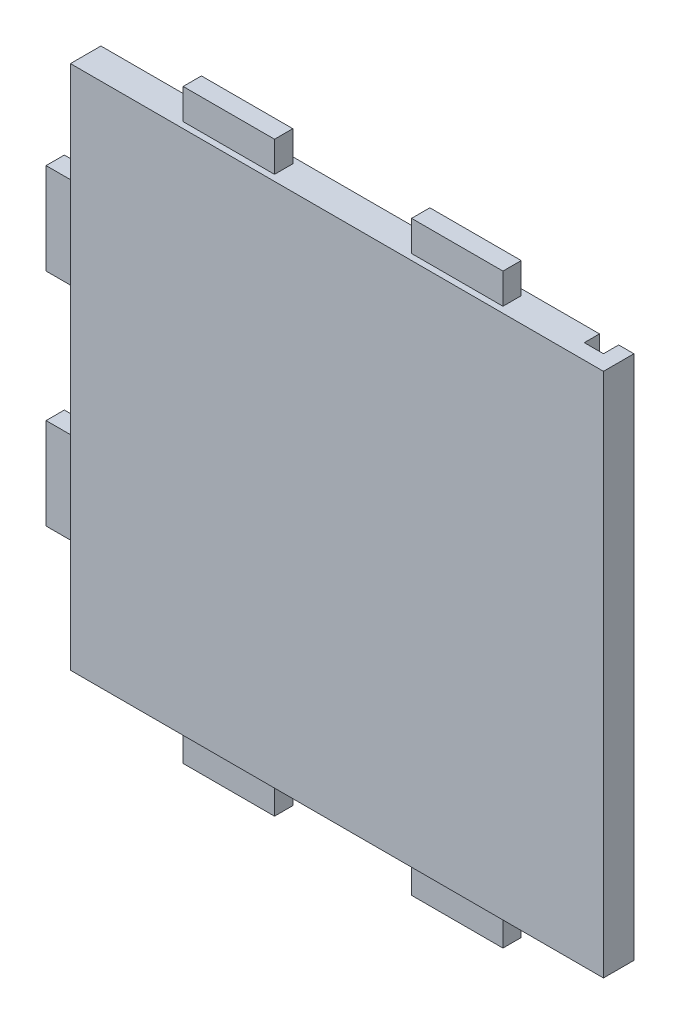
ISO-10303-21;
HEADER;
FILE_DESCRIPTION(('STEP AP214'),'2;1');
FILE_NAME('part.step','',(''),(''),'','','');
FILE_SCHEMA(('AUTOMOTIVE_DESIGN { 1 0 10303 214 1 1 1 1 }'));
ENDSEC;
DATA;
#1=APPLICATION_CONTEXT('core data for automotive mechanical design processes');
#2=APPLICATION_PROTOCOL_DEFINITION('international standard','automotive_design',2000,#1);
#3=PRODUCT_CONTEXT('',#1,'mechanical');
#4=PRODUCT('Part','Part','',(#3));
#5=PRODUCT_RELATED_PRODUCT_CATEGORY('part','',(#4));
#6=PRODUCT_DEFINITION_FORMATION('','',#4);
#7=PRODUCT_DEFINITION_CONTEXT('part definition',#1,'design');
#8=PRODUCT_DEFINITION('design','',#6,#7);
#9=PRODUCT_DEFINITION_SHAPE('','',#8);
#10=(LENGTH_UNIT() NAMED_UNIT(*) SI_UNIT(.MILLI.,.METRE.));
#11=(NAMED_UNIT(*) PLANE_ANGLE_UNIT() SI_UNIT($,.RADIAN.));
#12=(NAMED_UNIT(*) SI_UNIT($,.STERADIAN.) SOLID_ANGLE_UNIT());
#13=UNCERTAINTY_MEASURE_WITH_UNIT(LENGTH_MEASURE(1.E-05),#10,'distance_accuracy_value','');
#14=(GEOMETRIC_REPRESENTATION_CONTEXT(3) GLOBAL_UNCERTAINTY_ASSIGNED_CONTEXT((#13)) GLOBAL_UNIT_ASSIGNED_CONTEXT((#10,
#11,#12)) REPRESENTATION_CONTEXT('',''));
#15=CARTESIAN_POINT('',(0.,0.,0.));
#16=DIRECTION('',(0.,0.,1.));
#17=DIRECTION('',(1.,0.,0.));
#18=AXIS2_PLACEMENT_3D('',#15,#16,#17);
#19=CARTESIAN_POINT('',(0.,0.,0.));
#20=DIRECTION('',(0.,0.,1.));
#21=DIRECTION('',(1.,0.,0.));
#22=AXIS2_PLACEMENT_3D('',#19,#20,#21);
#23=PLANE('',#22);
#24=DIRECTION('',(1.,0.,0.));
#25=VECTOR('',#24,1.);
#26=CARTESIAN_POINT('',(87.5,-86.25,0.));
#27=LINE('',#26,#25);
#28=CARTESIAN_POINT('',(82.5,-86.25,0.));
#29=VERTEX_POINT('',#28);
#30=CARTESIAN_POINT('',(87.5,-86.25,0.));
#31=VERTEX_POINT('',#30);
#32=EDGE_CURVE('E487',#29,#31,#27,.T.);
#33=ORIENTED_EDGE('',*,*,#32,.F.);
#34=DIRECTION('',(0.,-1.,0.));
#35=VECTOR('',#34,1.);
#36=CARTESIAN_POINT('',(82.5,-86.25,0.));
#37=LINE('',#36,#35);
#38=CARTESIAN_POINT('',(82.5,86.25,0.));
#39=VERTEX_POINT('',#38);
#40=EDGE_CURVE('E246',#39,#29,#37,.T.);
#41=ORIENTED_EDGE('',*,*,#40,.F.);
#42=DIRECTION('',(-1.,0.,0.));
#43=VECTOR('',#42,1.);
#44=CARTESIAN_POINT('',(87.5,86.25,0.));
#45=LINE('',#44,#43);
#46=CARTESIAN_POINT('',(87.5,86.25,0.));
#47=VERTEX_POINT('',#46);
#48=EDGE_CURVE('E478',#47,#39,#45,.T.);
#49=ORIENTED_EDGE('',*,*,#48,.F.);
#50=DIRECTION('',(0.,1.,0.));
#51=VECTOR('',#50,1.);
#52=CARTESIAN_POINT('',(87.5,-86.25,0.));
#53=LINE('',#52,#51);
#54=EDGE_CURVE('E490',#31,#47,#53,.T.);
#55=ORIENTED_EDGE('',*,*,#54,.F.);
#56=EDGE_LOOP('',(#33,#41,#49,#55));
#57=FACE_BOUND('',#56,.T.);
#58=ADVANCED_FACE('F32',(#57),#23,.F.);
#59=CARTESIAN_POINT('',(87.5,-86.25,10.));
#60=DIRECTION('',(0.,1.,0.));
#61=DIRECTION('',(-1.,0.,0.));
#62=AXIS2_PLACEMENT_3D('',#59,#60,#61);
#63=PLANE('',#62);
#64=CARTESIAN_POINT('',(65.,-86.25,5.00000000000061));
#65=DIRECTION('',(0.,-1.,0.));
#66=DIRECTION('',(1.,0.,0.));
#67=AXIS2_PLACEMENT_3D('',#64,#65,#66);
#68=CIRCLE('',#67,1.5);
#69=CARTESIAN_POINT('',(66.5,-86.25,5.00000000000061));
#70=VERTEX_POINT('',#69);
#71=EDGE_CURVE('E764',#70,#70,#68,.T.);
#72=ORIENTED_EDGE('',*,*,#71,.F.);
#73=EDGE_LOOP('',(#72));
#74=FACE_BOUND('',#73,.T.);
#75=DIRECTION('',(0.,0.,-1.));
#76=VECTOR('',#75,1.);
#77=CARTESIAN_POINT('',(-52.5,-86.25,2.));
#78=LINE('',#77,#76);
#79=CARTESIAN_POINT('',(-52.5,-86.25,8.));
#80=VERTEX_POINT('',#79);
#81=CARTESIAN_POINT('',(-52.5,-86.25,2.));
#82=VERTEX_POINT('',#81);
#83=EDGE_CURVE('E308',#80,#82,#78,.T.);
#84=ORIENTED_EDGE('',*,*,#83,.F.);
#85=DIRECTION('',(-1.,0.,0.));
#86=VECTOR('',#85,1.);
#87=CARTESIAN_POINT('',(-22.5,-86.25,8.));
#88=LINE('',#87,#86);
#89=CARTESIAN_POINT('',(-22.5,-86.25,8.));
#90=VERTEX_POINT('',#89);
#91=EDGE_CURVE('E313',#90,#80,#88,.T.);
#92=ORIENTED_EDGE('',*,*,#91,.F.);
#93=DIRECTION('',(0.,0.,1.));
#94=VECTOR('',#93,1.);
#95=CARTESIAN_POINT('',(-22.5,-86.25,2.));
#96=LINE('',#95,#94);
#97=CARTESIAN_POINT('',(-22.5,-86.25,2.));
#98=VERTEX_POINT('',#97);
#99=EDGE_CURVE('E325',#98,#90,#96,.T.);
#100=ORIENTED_EDGE('',*,*,#99,.F.);
#101=DIRECTION('',(1.,0.,0.));
#102=VECTOR('',#101,1.);
#103=CARTESIAN_POINT('',(-22.5,-86.25,2.));
#104=LINE('',#103,#102);
#105=EDGE_CURVE('E322',#82,#98,#104,.T.);
#106=ORIENTED_EDGE('',*,*,#105,.F.);
#107=EDGE_LOOP('',(#84,#92,#100,#106));
#108=FACE_BOUND('',#107,.T.);
#109=DIRECTION('',(-1.,0.,0.));
#110=VECTOR('',#109,1.);
#111=CARTESIAN_POINT('',(76.2,-86.25,5.));
#112=LINE('',#111,#110);
#113=CARTESIAN_POINT('',(82.5,-86.25,5.));
#114=VERTEX_POINT('',#113);
#115=CARTESIAN_POINT('',(76.2,-86.25,5.));
#116=VERTEX_POINT('',#115);
#117=EDGE_CURVE('E256',#114,#116,#112,.T.);
#118=ORIENTED_EDGE('',*,*,#117,.F.);
#119=DIRECTION('',(0.,0.,-1.));
#120=VECTOR('',#119,1.);
#121=CARTESIAN_POINT('',(82.5,-86.25,5.));
#122=LINE('',#121,#120);
#123=EDGE_CURVE('E240',#114,#29,#122,.T.);
#124=ORIENTED_EDGE('',*,*,#123,.T.);
#125=ORIENTED_EDGE('',*,*,#32,.T.);
#126=DIRECTION('',(0.,0.,-1.));
#127=VECTOR('',#126,1.);
#128=CARTESIAN_POINT('',(87.5,-86.25,10.));
#129=LINE('',#128,#127);
#130=CARTESIAN_POINT('',(87.5,-86.25,10.));
#131=VERTEX_POINT('',#130);
#132=EDGE_CURVE('E40',#131,#31,#129,.T.);
#133=ORIENTED_EDGE('',*,*,#132,.F.);
#134=DIRECTION('',(1.,0.,0.));
#135=VECTOR('',#134,1.);
#136=CARTESIAN_POINT('',(87.5,-86.25,10.));
#137=LINE('',#136,#135);
#138=CARTESIAN_POINT('',(-87.5,-86.25,10.));
#139=VERTEX_POINT('',#138);
#140=EDGE_CURVE('E477',#139,#131,#137,.T.);
#141=ORIENTED_EDGE('',*,*,#140,.F.);
#142=DIRECTION('',(0.,0.,-1.));
#143=VECTOR('',#142,1.);
#144=CARTESIAN_POINT('',(-87.5,-86.25,10.));
#145=LINE('',#144,#143);
#146=CARTESIAN_POINT('',(-87.5,-86.25,0.));
#147=VERTEX_POINT('',#146);
#148=EDGE_CURVE('E11',#139,#147,#145,.T.);
#149=ORIENTED_EDGE('',*,*,#148,.T.);
#150=CARTESIAN_POINT('',(76.2,-86.25,0.));
#151=VERTEX_POINT('',#150);
#152=EDGE_CURVE('E488',#147,#151,#27,.T.);
#153=ORIENTED_EDGE('',*,*,#152,.T.);
#154=DIRECTION('',(0.,0.,-1.));
#155=VECTOR('',#154,1.);
#156=CARTESIAN_POINT('',(76.2,-86.25,5.));
#157=LINE('',#156,#155);
#158=EDGE_CURVE('E47',#116,#151,#157,.T.);
#159=ORIENTED_EDGE('',*,*,#158,.F.);
#160=EDGE_LOOP('',(#118,#124,#125,#133,#141,#149,#153,#159));
#161=FACE_BOUND('',#160,.T.);
#162=DIRECTION('',(0.,0.,-1.));
#163=VECTOR('',#162,1.);
#164=CARTESIAN_POINT('',(22.5,-86.25,2.));
#165=LINE('',#164,#163);
#166=CARTESIAN_POINT('',(22.5,-86.25,8.));
#167=VERTEX_POINT('',#166);
#168=CARTESIAN_POINT('',(22.5,-86.25,2.));
#169=VERTEX_POINT('',#168);
#170=EDGE_CURVE('E274',#167,#169,#165,.T.);
#171=ORIENTED_EDGE('',*,*,#170,.F.);
#172=DIRECTION('',(-1.,0.,0.));
#173=VECTOR('',#172,1.);
#174=CARTESIAN_POINT('',(22.5,-86.25,8.));
#175=LINE('',#174,#173);
#176=CARTESIAN_POINT('',(52.5,-86.25,8.));
#177=VERTEX_POINT('',#176);
#178=EDGE_CURVE('E283',#177,#167,#175,.T.);
#179=ORIENTED_EDGE('',*,*,#178,.F.);
#180=DIRECTION('',(0.,0.,1.));
#181=VECTOR('',#180,1.);
#182=CARTESIAN_POINT('',(52.5,-86.25,2.));
#183=LINE('',#182,#181);
#184=CARTESIAN_POINT('',(52.5,-86.25,2.));
#185=VERTEX_POINT('',#184);
#186=EDGE_CURVE('E293',#185,#177,#183,.T.);
#187=ORIENTED_EDGE('',*,*,#186,.F.);
#188=DIRECTION('',(1.,0.,0.));
#189=VECTOR('',#188,1.);
#190=CARTESIAN_POINT('',(22.5,-86.25,2.));
#191=LINE('',#190,#189);
#192=EDGE_CURVE('E55',#169,#185,#191,.T.);
#193=ORIENTED_EDGE('',*,*,#192,.F.);
#194=EDGE_LOOP('',(#171,#179,#187,#193));
#195=FACE_BOUND('',#194,.T.);
#196=ADVANCED_FACE('F261',(#74,#108,#161,#195),#63,.F.);
#197=CARTESIAN_POINT('',(-87.5,-86.25,10.));
#198=DIRECTION('',(1.,0.,0.));
#199=DIRECTION('',(0.,0.,-1.));
#200=AXIS2_PLACEMENT_3D('',#197,#198,#199);
#201=PLANE('',#200);
#202=CARTESIAN_POINT('',(-87.5,-71.25,5.00000000000002));
#203=DIRECTION('',(-1.,0.,0.));
#204=DIRECTION('',(0.,0.,1.));
#205=AXIS2_PLACEMENT_3D('',#202,#203,#204);
#206=CIRCLE('',#205,1.5);
#207=CARTESIAN_POINT('',(-87.5,-71.25,6.50000000000002));
#208=VERTEX_POINT('',#207);
#209=EDGE_CURVE('E763',#208,#208,#206,.T.);
#210=ORIENTED_EDGE('',*,*,#209,.F.);
#211=EDGE_LOOP('',(#210));
#212=FACE_BOUND('',#211,.T.);
#213=DIRECTION('',(0.,-1.,0.));
#214=VECTOR('',#213,1.);
#215=CARTESIAN_POINT('',(-87.5,21.25,2.00000000000001));
#216=LINE('',#215,#214);
#217=CARTESIAN_POINT('',(-87.5,51.25,2.00000000000001));
#218=VERTEX_POINT('',#217);
#219=CARTESIAN_POINT('',(-87.5,21.25,2.00000000000001));
#220=VERTEX_POINT('',#219);
#221=EDGE_CURVE('E374',#218,#220,#216,.T.);
#222=ORIENTED_EDGE('',*,*,#221,.F.);
#223=DIRECTION('',(0.,0.,-1.));
#224=VECTOR('',#223,1.);
#225=CARTESIAN_POINT('',(-87.5,51.25,8.00000000000001));
#226=LINE('',#225,#224);
#227=CARTESIAN_POINT('',(-87.5,51.25,8.00000000000001));
#228=VERTEX_POINT('',#227);
#229=EDGE_CURVE('E379',#228,#218,#226,.T.);
#230=ORIENTED_EDGE('',*,*,#229,.F.);
#231=DIRECTION('',(0.,1.,0.));
#232=VECTOR('',#231,1.);
#233=CARTESIAN_POINT('',(-87.5,21.25,8.00000000000001));
#234=LINE('',#233,#232);
#235=CARTESIAN_POINT('',(-87.5,21.25,8.00000000000001));
#236=VERTEX_POINT('',#235);
#237=EDGE_CURVE('E391',#236,#228,#234,.T.);
#238=ORIENTED_EDGE('',*,*,#237,.F.);
#239=DIRECTION('',(0.,0.,1.));
#240=VECTOR('',#239,1.);
#241=CARTESIAN_POINT('',(-87.5,21.25,8.00000000000001));
#242=LINE('',#241,#240);
#243=EDGE_CURVE('E388',#220,#236,#242,.T.);
#244=ORIENTED_EDGE('',*,*,#243,.F.);
#245=EDGE_LOOP('',(#222,#230,#238,#244));
#246=FACE_BOUND('',#245,.T.);
#247=DIRECTION('',(0.,-1.,0.));
#248=VECTOR('',#247,1.);
#249=CARTESIAN_POINT('',(-87.5,-86.25,0.));
#250=LINE('',#249,#248);
#251=CARTESIAN_POINT('',(-87.5,86.25,0.));
#252=VERTEX_POINT('',#251);
#253=EDGE_CURVE('E473',#252,#147,#250,.T.);
#254=ORIENTED_EDGE('',*,*,#253,.T.);
#255=ORIENTED_EDGE('',*,*,#148,.F.);
#256=DIRECTION('',(0.,-1.,0.));
#257=VECTOR('',#256,1.);
#258=CARTESIAN_POINT('',(-87.5,-86.25,10.));
#259=LINE('',#258,#257);
#260=CARTESIAN_POINT('',(-87.5,86.25,10.));
#261=VERTEX_POINT('',#260);
#262=EDGE_CURVE('E474',#261,#139,#259,.T.);
#263=ORIENTED_EDGE('',*,*,#262,.F.);
#264=DIRECTION('',(0.,0.,-1.));
#265=VECTOR('',#264,1.);
#266=CARTESIAN_POINT('',(-87.5,86.25,10.));
#267=LINE('',#266,#265);
#268=EDGE_CURVE('E484',#261,#252,#267,.T.);
#269=ORIENTED_EDGE('',*,*,#268,.T.);
#270=EDGE_LOOP('',(#254,#255,#263,#269));
#271=FACE_BOUND('',#270,.T.);
#272=DIRECTION('',(0.,1.,0.));
#273=VECTOR('',#272,1.);
#274=CARTESIAN_POINT('',(-87.5,-21.25,8.00000000000001));
#275=LINE('',#274,#273);
#276=CARTESIAN_POINT('',(-87.5,-51.25,8.00000000000001));
#277=VERTEX_POINT('',#276);
#278=CARTESIAN_POINT('',(-87.5,-21.25,8.00000000000001));
#279=VERTEX_POINT('',#278);
#280=EDGE_CURVE('E341',#277,#279,#275,.T.);
#281=ORIENTED_EDGE('',*,*,#280,.F.);
#282=DIRECTION('',(0.,0.,1.));
#283=VECTOR('',#282,1.);
#284=CARTESIAN_POINT('',(-87.5,-51.25,8.00000000000001));
#285=LINE('',#284,#283);
#286=CARTESIAN_POINT('',(-87.5,-51.25,2.00000000000001));
#287=VERTEX_POINT('',#286);
#288=EDGE_CURVE('E346',#287,#277,#285,.T.);
#289=ORIENTED_EDGE('',*,*,#288,.F.);
#290=DIRECTION('',(0.,-1.,0.));
#291=VECTOR('',#290,1.);
#292=CARTESIAN_POINT('',(-87.5,-21.25,2.00000000000001));
#293=LINE('',#292,#291);
#294=CARTESIAN_POINT('',(-87.5,-21.25,2.00000000000001));
#295=VERTEX_POINT('',#294);
#296=EDGE_CURVE('E358',#295,#287,#293,.T.);
#297=ORIENTED_EDGE('',*,*,#296,.F.);
#298=DIRECTION('',(0.,0.,-1.));
#299=VECTOR('',#298,1.);
#300=CARTESIAN_POINT('',(-87.5,-21.25,8.00000000000001));
#301=LINE('',#300,#299);
#302=EDGE_CURVE('E355',#279,#295,#301,.T.);
#303=ORIENTED_EDGE('',*,*,#302,.F.);
#304=EDGE_LOOP('',(#281,#289,#297,#303));
#305=FACE_BOUND('',#304,.T.);
#306=ADVANCED_FACE('F34',(#212,#246,#271,#305),#201,.F.);
#307=CARTESIAN_POINT('',(87.5,86.25,10.));
#308=DIRECTION('',(0.,-1.,0.));
#309=DIRECTION('',(1.,0.,0.));
#310=AXIS2_PLACEMENT_3D('',#307,#308,#309);
#311=PLANE('',#310);
#312=ORIENTED_EDGE('',*,*,#48,.T.);
#313=DIRECTION('',(0.,0.,-1.));
#314=VECTOR('',#313,1.);
#315=CARTESIAN_POINT('',(82.5,86.25,5.));
#316=LINE('',#315,#314);
#317=CARTESIAN_POINT('',(82.5,86.25,5.));
#318=VERTEX_POINT('',#317);
#319=EDGE_CURVE('E272',#318,#39,#316,.T.);
#320=ORIENTED_EDGE('',*,*,#319,.F.);
#321=DIRECTION('',(1.,0.,0.));
#322=VECTOR('',#321,1.);
#323=CARTESIAN_POINT('',(76.2,86.25,5.));
#324=LINE('',#323,#322);
#325=CARTESIAN_POINT('',(76.2,86.25,5.));
#326=VERTEX_POINT('',#325);
#327=EDGE_CURVE('E250',#326,#318,#324,.T.);
#328=ORIENTED_EDGE('',*,*,#327,.F.);
#329=DIRECTION('',(0.,0.,-1.));
#330=VECTOR('',#329,1.);
#331=CARTESIAN_POINT('',(76.2,86.25,5.));
#332=LINE('',#331,#330);
#333=CARTESIAN_POINT('',(76.2,86.25,0.));
#334=VERTEX_POINT('',#333);
#335=EDGE_CURVE('E275',#326,#334,#332,.T.);
#336=ORIENTED_EDGE('',*,*,#335,.T.);
#337=EDGE_CURVE('E492',#334,#252,#45,.T.);
#338=ORIENTED_EDGE('',*,*,#337,.T.);
#339=ORIENTED_EDGE('',*,*,#268,.F.);
#340=DIRECTION('',(-1.,0.,0.));
#341=VECTOR('',#340,1.);
#342=CARTESIAN_POINT('',(87.5,86.25,10.));
#343=LINE('',#342,#341);
#344=CARTESIAN_POINT('',(87.5,86.25,10.));
#345=VERTEX_POINT('',#344);
#346=EDGE_CURVE('E482',#345,#261,#343,.T.);
#347=ORIENTED_EDGE('',*,*,#346,.F.);
#348=DIRECTION('',(0.,0.,-1.));
#349=VECTOR('',#348,1.);
#350=CARTESIAN_POINT('',(87.5,86.25,10.));
#351=LINE('',#350,#349);
#352=EDGE_CURVE('E497',#345,#47,#351,.T.);
#353=ORIENTED_EDGE('',*,*,#352,.T.);
#354=EDGE_LOOP('',(#312,#320,#328,#336,#338,#339,#347,#353));
#355=FACE_BOUND('',#354,.T.);
#356=DIRECTION('',(0.,0.,1.));
#357=VECTOR('',#356,1.);
#358=CARTESIAN_POINT('',(-52.5,86.25,7.99999999999998));
#359=LINE('',#358,#357);
#360=CARTESIAN_POINT('',(-52.5,86.25,1.99999999999999));
#361=VERTEX_POINT('',#360);
#362=CARTESIAN_POINT('',(-52.5,86.25,7.99999999999998));
#363=VERTEX_POINT('',#362);
#364=EDGE_CURVE('E440',#361,#363,#359,.T.);
#365=ORIENTED_EDGE('',*,*,#364,.F.);
#366=DIRECTION('',(-1.,0.,0.));
#367=VECTOR('',#366,1.);
#368=CARTESIAN_POINT('',(-22.5,86.25,1.99999999999998));
#369=LINE('',#368,#367);
#370=CARTESIAN_POINT('',(-22.5,86.25,1.99999999999998));
#371=VERTEX_POINT('',#370);
#372=EDGE_CURVE('E445',#371,#361,#369,.T.);
#373=ORIENTED_EDGE('',*,*,#372,.F.);
#374=DIRECTION('',(0.,0.,-1.));
#375=VECTOR('',#374,1.);
#376=CARTESIAN_POINT('',(-22.5,86.25,7.99999999999998));
#377=LINE('',#376,#375);
#378=CARTESIAN_POINT('',(-22.5,86.25,7.99999999999998));
#379=VERTEX_POINT('',#378);
#380=EDGE_CURVE('E457',#379,#371,#377,.T.);
#381=ORIENTED_EDGE('',*,*,#380,.F.);
#382=DIRECTION('',(1.,0.,0.));
#383=VECTOR('',#382,1.);
#384=CARTESIAN_POINT('',(-22.5,86.25,7.99999999999998));
#385=LINE('',#384,#383);
#386=EDGE_CURVE('E454',#363,#379,#385,.T.);
#387=ORIENTED_EDGE('',*,*,#386,.F.);
#388=EDGE_LOOP('',(#365,#373,#381,#387));
#389=FACE_BOUND('',#388,.T.);
#390=DIRECTION('',(0.,0.,1.));
#391=VECTOR('',#390,1.);
#392=CARTESIAN_POINT('',(22.5,86.25,7.99999999999998));
#393=LINE('',#392,#391);
#394=CARTESIAN_POINT('',(22.5,86.25,1.99999999999998));
#395=VERTEX_POINT('',#394);
#396=CARTESIAN_POINT('',(22.5,86.25,7.99999999999998));
#397=VERTEX_POINT('',#396);
#398=EDGE_CURVE('E407',#395,#397,#393,.T.);
#399=ORIENTED_EDGE('',*,*,#398,.F.);
#400=DIRECTION('',(-1.,0.,0.));
#401=VECTOR('',#400,1.);
#402=CARTESIAN_POINT('',(22.5,86.25,1.99999999999998));
#403=LINE('',#402,#401);
#404=CARTESIAN_POINT('',(52.5,86.25,1.99999999999997));
#405=VERTEX_POINT('',#404);
#406=EDGE_CURVE('E412',#405,#395,#403,.T.);
#407=ORIENTED_EDGE('',*,*,#406,.F.);
#408=DIRECTION('',(0.,0.,-1.));
#409=VECTOR('',#408,1.);
#410=CARTESIAN_POINT('',(52.5,86.25,7.99999999999997));
#411=LINE('',#410,#409);
#412=CARTESIAN_POINT('',(52.5,86.25,7.99999999999997));
#413=VERTEX_POINT('',#412);
#414=EDGE_CURVE('E424',#413,#405,#411,.T.);
#415=ORIENTED_EDGE('',*,*,#414,.F.);
#416=DIRECTION('',(1.,0.,0.));
#417=VECTOR('',#416,1.);
#418=CARTESIAN_POINT('',(22.5,86.25,7.99999999999998));
#419=LINE('',#418,#417);
#420=EDGE_CURVE('E421',#397,#413,#419,.T.);
#421=ORIENTED_EDGE('',*,*,#420,.F.);
#422=EDGE_LOOP('',(#399,#407,#415,#421));
#423=FACE_BOUND('',#422,.T.);
#424=ADVANCED_FACE('F509',(#355,#389,#423),#311,.F.);
#425=CARTESIAN_POINT('',(87.5,-86.25,10.));
#426=DIRECTION('',(-1.,0.,0.));
#427=DIRECTION('',(0.,0.,1.));
#428=AXIS2_PLACEMENT_3D('',#425,#426,#427);
#429=PLANE('',#428);
#430=ORIENTED_EDGE('',*,*,#54,.T.);
#431=ORIENTED_EDGE('',*,*,#352,.F.);
#432=DIRECTION('',(0.,1.,0.));
#433=VECTOR('',#432,1.);
#434=CARTESIAN_POINT('',(87.5,-86.25,10.));
#435=LINE('',#434,#433);
#436=EDGE_CURVE('E480',#131,#345,#435,.T.);
#437=ORIENTED_EDGE('',*,*,#436,.F.);
#438=ORIENTED_EDGE('',*,*,#132,.T.);
#439=EDGE_LOOP('',(#430,#431,#437,#438));
#440=FACE_BOUND('',#439,.T.);
#441=ADVANCED_FACE('F504',(#440),#429,.F.);
#442=CARTESIAN_POINT('',(0.,0.,10.));
#443=DIRECTION('',(0.,0.,1.));
#444=DIRECTION('',(1.,0.,0.));
#445=AXIS2_PLACEMENT_3D('',#442,#443,#444);
#446=PLANE('',#445);
#447=ORIENTED_EDGE('',*,*,#262,.T.);
#448=ORIENTED_EDGE('',*,*,#140,.T.);
#449=ORIENTED_EDGE('',*,*,#436,.T.);
#450=ORIENTED_EDGE('',*,*,#346,.T.);
#451=EDGE_LOOP('',(#447,#448,#449,#450));
#452=FACE_BOUND('',#451,.T.);
#453=ADVANCED_FACE('F515',(#452),#446,.T.);
#454=ORIENTED_EDGE('',*,*,#337,.F.);
#455=DIRECTION('',(0.,1.,0.));
#456=VECTOR('',#455,1.);
#457=CARTESIAN_POINT('',(76.2,-86.25,0.));
#458=LINE('',#457,#456);
#459=EDGE_CURVE('E259',#151,#334,#458,.T.);
#460=ORIENTED_EDGE('',*,*,#459,.F.);
#461=ORIENTED_EDGE('',*,*,#152,.F.);
#462=ORIENTED_EDGE('',*,*,#253,.F.);
#463=EDGE_LOOP('',(#454,#460,#461,#462));
#464=FACE_BOUND('',#463,.T.);
#465=ADVANCED_FACE('F522',(#464),#23,.F.);
#466=CARTESIAN_POINT('',(-52.5,96.25,7.99999999999998));
#467=DIRECTION('',(1.,0.,0.));
#468=DIRECTION('',(0.,1.,0.));
#469=AXIS2_PLACEMENT_3D('',#466,#467,#468);
#470=PLANE('',#469);
#471=ORIENTED_EDGE('',*,*,#364,.T.);
#472=DIRECTION('',(0.,-1.,0.));
#473=VECTOR('',#472,1.);
#474=CARTESIAN_POINT('',(-52.5,96.25,7.99999999999998));
#475=LINE('',#474,#473);
#476=CARTESIAN_POINT('',(-52.5,96.25,7.99999999999998));
#477=VERTEX_POINT('',#476);
#478=EDGE_CURVE('E470',#477,#363,#475,.T.);
#479=ORIENTED_EDGE('',*,*,#478,.F.);
#480=DIRECTION('',(0.,0.,1.));
#481=VECTOR('',#480,1.);
#482=CARTESIAN_POINT('',(-52.5,96.25,7.99999999999998));
#483=LINE('',#482,#481);
#484=CARTESIAN_POINT('',(-52.5,96.25,1.99999999999999));
#485=VERTEX_POINT('',#484);
#486=EDGE_CURVE('E441',#485,#477,#483,.T.);
#487=ORIENTED_EDGE('',*,*,#486,.F.);
#488=DIRECTION('',(0.,-1.,0.));
#489=VECTOR('',#488,1.);
#490=CARTESIAN_POINT('',(-52.5,96.25,1.99999999999999));
#491=LINE('',#490,#489);
#492=EDGE_CURVE('E451',#485,#361,#491,.T.);
#493=ORIENTED_EDGE('',*,*,#492,.T.);
#494=EDGE_LOOP('',(#471,#479,#487,#493));
#495=FACE_BOUND('',#494,.T.);
#496=ADVANCED_FACE('F543',(#495),#470,.F.);
#497=CARTESIAN_POINT('',(-22.5,96.25,7.99999999999998));
#498=DIRECTION('',(0.,0.,-1.));
#499=DIRECTION('',(-1.,0.,0.));
#500=AXIS2_PLACEMENT_3D('',#497,#498,#499);
#501=PLANE('',#500);
#502=ORIENTED_EDGE('',*,*,#386,.T.);
#503=DIRECTION('',(0.,-1.,0.));
#504=VECTOR('',#503,1.);
#505=CARTESIAN_POINT('',(-22.5,96.25,7.99999999999998));
#506=LINE('',#505,#504);
#507=CARTESIAN_POINT('',(-22.5,96.25,7.99999999999998));
#508=VERTEX_POINT('',#507);
#509=EDGE_CURVE('E467',#508,#379,#506,.T.);
#510=ORIENTED_EDGE('',*,*,#509,.F.);
#511=DIRECTION('',(1.,0.,0.));
#512=VECTOR('',#511,1.);
#513=CARTESIAN_POINT('',(-22.5,96.25,7.99999999999998));
#514=LINE('',#513,#512);
#515=EDGE_CURVE('E444',#477,#508,#514,.T.);
#516=ORIENTED_EDGE('',*,*,#515,.F.);
#517=ORIENTED_EDGE('',*,*,#478,.T.);
#518=EDGE_LOOP('',(#502,#510,#516,#517));
#519=FACE_BOUND('',#518,.T.);
#520=ADVANCED_FACE('F548',(#519),#501,.F.);
#521=CARTESIAN_POINT('',(-22.5,96.25,7.99999999999998));
#522=DIRECTION('',(-1.,0.,0.));
#523=DIRECTION('',(0.,-1.,0.));
#524=AXIS2_PLACEMENT_3D('',#521,#522,#523);
#525=PLANE('',#524);
#526=ORIENTED_EDGE('',*,*,#380,.T.);
#527=DIRECTION('',(0.,-1.,0.));
#528=VECTOR('',#527,1.);
#529=CARTESIAN_POINT('',(-22.5,96.25,1.99999999999998));
#530=LINE('',#529,#528);
#531=CARTESIAN_POINT('',(-22.5,96.25,1.99999999999998));
#532=VERTEX_POINT('',#531);
#533=EDGE_CURVE('E464',#532,#371,#530,.T.);
#534=ORIENTED_EDGE('',*,*,#533,.F.);
#535=DIRECTION('',(0.,0.,-1.));
#536=VECTOR('',#535,1.);
#537=CARTESIAN_POINT('',(-22.5,96.25,7.99999999999998));
#538=LINE('',#537,#536);
#539=EDGE_CURVE('E447',#508,#532,#538,.T.);
#540=ORIENTED_EDGE('',*,*,#539,.F.);
#541=ORIENTED_EDGE('',*,*,#509,.T.);
#542=EDGE_LOOP('',(#526,#534,#540,#541));
#543=FACE_BOUND('',#542,.T.);
#544=ADVANCED_FACE('F558',(#543),#525,.F.);
#545=CARTESIAN_POINT('',(-22.5,96.25,1.99999999999998));
#546=DIRECTION('',(0.,0.,1.));
#547=DIRECTION('',(1.,0.,0.));
#548=AXIS2_PLACEMENT_3D('',#545,#546,#547);
#549=PLANE('',#548);
#550=ORIENTED_EDGE('',*,*,#372,.T.);
#551=ORIENTED_EDGE('',*,*,#492,.F.);
#552=DIRECTION('',(-1.,0.,0.));
#553=VECTOR('',#552,1.);
#554=CARTESIAN_POINT('',(-22.5,96.25,1.99999999999998));
#555=LINE('',#554,#553);
#556=EDGE_CURVE('E449',#532,#485,#555,.T.);
#557=ORIENTED_EDGE('',*,*,#556,.F.);
#558=ORIENTED_EDGE('',*,*,#533,.T.);
#559=EDGE_LOOP('',(#550,#551,#557,#558));
#560=FACE_BOUND('',#559,.T.);
#561=ADVANCED_FACE('F562',(#560),#549,.F.);
#562=CARTESIAN_POINT('',(0.,96.25,0.));
#563=DIRECTION('',(0.,1.,0.));
#564=DIRECTION('',(0.,0.,1.));
#565=AXIS2_PLACEMENT_3D('',#562,#563,#564);
#566=PLANE('',#565);
#567=ORIENTED_EDGE('',*,*,#486,.T.);
#568=ORIENTED_EDGE('',*,*,#515,.T.);
#569=ORIENTED_EDGE('',*,*,#539,.T.);
#570=ORIENTED_EDGE('',*,*,#556,.T.);
#571=EDGE_LOOP('',(#567,#568,#569,#570));
#572=FACE_BOUND('',#571,.T.);
#573=ADVANCED_FACE('F566',(#572),#566,.T.);
#574=CARTESIAN_POINT('',(22.5,96.25,7.99999999999998));
#575=DIRECTION('',(1.,0.,0.));
#576=DIRECTION('',(0.,1.,0.));
#577=AXIS2_PLACEMENT_3D('',#574,#575,#576);
#578=PLANE('',#577);
#579=ORIENTED_EDGE('',*,*,#398,.T.);
#580=DIRECTION('',(0.,-1.,0.));
#581=VECTOR('',#580,1.);
#582=CARTESIAN_POINT('',(22.5,96.25,7.99999999999998));
#583=LINE('',#582,#581);
#584=CARTESIAN_POINT('',(22.5,96.25,7.99999999999998));
#585=VERTEX_POINT('',#584);
#586=EDGE_CURVE('E437',#585,#397,#583,.T.);
#587=ORIENTED_EDGE('',*,*,#586,.F.);
#588=DIRECTION('',(0.,0.,1.));
#589=VECTOR('',#588,1.);
#590=CARTESIAN_POINT('',(22.5,96.25,7.99999999999998));
#591=LINE('',#590,#589);
#592=CARTESIAN_POINT('',(22.5,96.25,1.99999999999998));
#593=VERTEX_POINT('',#592);
#594=EDGE_CURVE('E408',#593,#585,#591,.T.);
#595=ORIENTED_EDGE('',*,*,#594,.F.);
#596=DIRECTION('',(0.,-1.,0.));
#597=VECTOR('',#596,1.);
#598=CARTESIAN_POINT('',(22.5,96.25,1.99999999999998));
#599=LINE('',#598,#597);
#600=EDGE_CURVE('E418',#593,#395,#599,.T.);
#601=ORIENTED_EDGE('',*,*,#600,.T.);
#602=EDGE_LOOP('',(#579,#587,#595,#601));
#603=FACE_BOUND('',#602,.T.);
#604=ADVANCED_FACE('F570',(#603),#578,.F.);
#605=CARTESIAN_POINT('',(22.5,96.25,7.99999999999998));
#606=DIRECTION('',(0.,0.,-1.));
#607=DIRECTION('',(-1.,0.,0.));
#608=AXIS2_PLACEMENT_3D('',#605,#606,#607);
#609=PLANE('',#608);
#610=ORIENTED_EDGE('',*,*,#420,.T.);
#611=DIRECTION('',(0.,-1.,0.));
#612=VECTOR('',#611,1.);
#613=CARTESIAN_POINT('',(52.5,96.25,7.99999999999997));
#614=LINE('',#613,#612);
#615=CARTESIAN_POINT('',(52.5,96.25,7.99999999999997));
#616=VERTEX_POINT('',#615);
#617=EDGE_CURVE('E434',#616,#413,#614,.T.);
#618=ORIENTED_EDGE('',*,*,#617,.F.);
#619=DIRECTION('',(1.,0.,0.));
#620=VECTOR('',#619,1.);
#621=CARTESIAN_POINT('',(22.5,96.25,7.99999999999998));
#622=LINE('',#621,#620);
#623=EDGE_CURVE('E411',#585,#616,#622,.T.);
#624=ORIENTED_EDGE('',*,*,#623,.F.);
#625=ORIENTED_EDGE('',*,*,#586,.T.);
#626=EDGE_LOOP('',(#610,#618,#624,#625));
#627=FACE_BOUND('',#626,.T.);
#628=ADVANCED_FACE('F574',(#627),#609,.F.);
#629=CARTESIAN_POINT('',(52.5,96.25,7.99999999999997));
#630=DIRECTION('',(-1.,0.,0.));
#631=DIRECTION('',(0.,-1.,0.));
#632=AXIS2_PLACEMENT_3D('',#629,#630,#631);
#633=PLANE('',#632);
#634=ORIENTED_EDGE('',*,*,#414,.T.);
#635=DIRECTION('',(0.,-1.,0.));
#636=VECTOR('',#635,1.);
#637=CARTESIAN_POINT('',(52.5,96.25,1.99999999999997));
#638=LINE('',#637,#636);
#639=CARTESIAN_POINT('',(52.5,96.25,1.99999999999997));
#640=VERTEX_POINT('',#639);
#641=EDGE_CURVE('E431',#640,#405,#638,.T.);
#642=ORIENTED_EDGE('',*,*,#641,.F.);
#643=DIRECTION('',(0.,0.,-1.));
#644=VECTOR('',#643,1.);
#645=CARTESIAN_POINT('',(52.5,96.25,7.99999999999997));
#646=LINE('',#645,#644);
#647=EDGE_CURVE('E414',#616,#640,#646,.T.);
#648=ORIENTED_EDGE('',*,*,#647,.F.);
#649=ORIENTED_EDGE('',*,*,#617,.T.);
#650=EDGE_LOOP('',(#634,#642,#648,#649));
#651=FACE_BOUND('',#650,.T.);
#652=ADVANCED_FACE('F578',(#651),#633,.F.);
#653=CARTESIAN_POINT('',(22.5,96.25,1.99999999999998));
#654=DIRECTION('',(0.,0.,1.));
#655=DIRECTION('',(1.,0.,0.));
#656=AXIS2_PLACEMENT_3D('',#653,#654,#655);
#657=PLANE('',#656);
#658=ORIENTED_EDGE('',*,*,#406,.T.);
#659=ORIENTED_EDGE('',*,*,#600,.F.);
#660=DIRECTION('',(-1.,0.,0.));
#661=VECTOR('',#660,1.);
#662=CARTESIAN_POINT('',(22.5,96.25,1.99999999999998));
#663=LINE('',#662,#661);
#664=EDGE_CURVE('E416',#640,#593,#663,.T.);
#665=ORIENTED_EDGE('',*,*,#664,.F.);
#666=ORIENTED_EDGE('',*,*,#641,.T.);
#667=EDGE_LOOP('',(#658,#659,#665,#666));
#668=FACE_BOUND('',#667,.T.);
#669=ADVANCED_FACE('F582',(#668),#657,.F.);
#670=CARTESIAN_POINT('',(0.,96.25,0.));
#671=DIRECTION('',(0.,-1.,0.));
#672=DIRECTION('',(0.,0.,-1.));
#673=AXIS2_PLACEMENT_3D('',#670,#671,#672);
#674=PLANE('',#673);
#675=ORIENTED_EDGE('',*,*,#594,.T.);
#676=ORIENTED_EDGE('',*,*,#623,.T.);
#677=ORIENTED_EDGE('',*,*,#647,.T.);
#678=ORIENTED_EDGE('',*,*,#664,.T.);
#679=EDGE_LOOP('',(#675,#676,#677,#678));
#680=FACE_BOUND('',#679,.T.);
#681=ADVANCED_FACE('F586',(#680),#674,.F.);
#682=CARTESIAN_POINT('',(-97.5,21.25,2.00000000000001));
#683=DIRECTION('',(0.,0.,1.));
#684=DIRECTION('',(1.,0.,0.));
#685=AXIS2_PLACEMENT_3D('',#682,#683,#684);
#686=PLANE('',#685);
#687=ORIENTED_EDGE('',*,*,#221,.T.);
#688=DIRECTION('',(1.,0.,0.));
#689=VECTOR('',#688,1.);
#690=CARTESIAN_POINT('',(-97.5,21.25,2.00000000000001));
#691=LINE('',#690,#689);
#692=CARTESIAN_POINT('',(-97.5,21.25,2.00000000000001));
#693=VERTEX_POINT('',#692);
#694=EDGE_CURVE('E404',#693,#220,#691,.T.);
#695=ORIENTED_EDGE('',*,*,#694,.F.);
#696=DIRECTION('',(0.,-1.,0.));
#697=VECTOR('',#696,1.);
#698=CARTESIAN_POINT('',(-97.5,21.25,2.00000000000001));
#699=LINE('',#698,#697);
#700=CARTESIAN_POINT('',(-97.5,51.25,2.00000000000001));
#701=VERTEX_POINT('',#700);
#702=EDGE_CURVE('E375',#701,#693,#699,.T.);
#703=ORIENTED_EDGE('',*,*,#702,.F.);
#704=DIRECTION('',(1.,0.,0.));
#705=VECTOR('',#704,1.);
#706=CARTESIAN_POINT('',(-97.5,51.25,2.00000000000001));
#707=LINE('',#706,#705);
#708=EDGE_CURVE('E385',#701,#218,#707,.T.);
#709=ORIENTED_EDGE('',*,*,#708,.T.);
#710=EDGE_LOOP('',(#687,#695,#703,#709));
#711=FACE_BOUND('',#710,.T.);
#712=ADVANCED_FACE('F590',(#711),#686,.F.);
#713=CARTESIAN_POINT('',(-97.5,21.25,8.00000000000001));
#714=DIRECTION('',(0.,1.,0.));
#715=DIRECTION('',(0.,0.,1.));
#716=AXIS2_PLACEMENT_3D('',#713,#714,#715);
#717=PLANE('',#716);
#718=ORIENTED_EDGE('',*,*,#243,.T.);
#719=DIRECTION('',(1.,0.,0.));
#720=VECTOR('',#719,1.);
#721=CARTESIAN_POINT('',(-97.5,21.25,8.00000000000001));
#722=LINE('',#721,#720);
#723=CARTESIAN_POINT('',(-97.5,21.25,8.00000000000001));
#724=VERTEX_POINT('',#723);
#725=EDGE_CURVE('E401',#724,#236,#722,.T.);
#726=ORIENTED_EDGE('',*,*,#725,.F.);
#727=DIRECTION('',(0.,0.,1.));
#728=VECTOR('',#727,1.);
#729=CARTESIAN_POINT('',(-97.5,21.25,8.00000000000001));
#730=LINE('',#729,#728);
#731=EDGE_CURVE('E378',#693,#724,#730,.T.);
#732=ORIENTED_EDGE('',*,*,#731,.F.);
#733=ORIENTED_EDGE('',*,*,#694,.T.);
#734=EDGE_LOOP('',(#718,#726,#732,#733));
#735=FACE_BOUND('',#734,.T.);
#736=ADVANCED_FACE('F594',(#735),#717,.F.);
#737=CARTESIAN_POINT('',(-97.5,21.25,8.00000000000001));
#738=DIRECTION('',(0.,0.,-1.));
#739=DIRECTION('',(-1.,0.,0.));
#740=AXIS2_PLACEMENT_3D('',#737,#738,#739);
#741=PLANE('',#740);
#742=ORIENTED_EDGE('',*,*,#237,.T.);
#743=DIRECTION('',(1.,0.,0.));
#744=VECTOR('',#743,1.);
#745=CARTESIAN_POINT('',(-97.5,51.25,8.00000000000001));
#746=LINE('',#745,#744);
#747=CARTESIAN_POINT('',(-97.5,51.25,8.00000000000001));
#748=VERTEX_POINT('',#747);
#749=EDGE_CURVE('E398',#748,#228,#746,.T.);
#750=ORIENTED_EDGE('',*,*,#749,.F.);
#751=DIRECTION('',(0.,1.,0.));
#752=VECTOR('',#751,1.);
#753=CARTESIAN_POINT('',(-97.5,21.25,8.00000000000001));
#754=LINE('',#753,#752);
#755=EDGE_CURVE('E381',#724,#748,#754,.T.);
#756=ORIENTED_EDGE('',*,*,#755,.F.);
#757=ORIENTED_EDGE('',*,*,#725,.T.);
#758=EDGE_LOOP('',(#742,#750,#756,#757));
#759=FACE_BOUND('',#758,.T.);
#760=ADVANCED_FACE('F598',(#759),#741,.F.);
#761=CARTESIAN_POINT('',(-97.5,51.25,8.00000000000001));
#762=DIRECTION('',(0.,-1.,0.));
#763=DIRECTION('',(0.,0.,-1.));
#764=AXIS2_PLACEMENT_3D('',#761,#762,#763);
#765=PLANE('',#764);
#766=ORIENTED_EDGE('',*,*,#229,.T.);
#767=ORIENTED_EDGE('',*,*,#708,.F.);
#768=DIRECTION('',(0.,0.,-1.));
#769=VECTOR('',#768,1.);
#770=CARTESIAN_POINT('',(-97.5,51.25,8.00000000000001));
#771=LINE('',#770,#769);
#772=EDGE_CURVE('E383',#748,#701,#771,.T.);
#773=ORIENTED_EDGE('',*,*,#772,.F.);
#774=ORIENTED_EDGE('',*,*,#749,.T.);
#775=EDGE_LOOP('',(#766,#767,#773,#774));
#776=FACE_BOUND('',#775,.T.);
#777=ADVANCED_FACE('F602',(#776),#765,.F.);
#778=CARTESIAN_POINT('',(-97.5,0.,0.));
#779=DIRECTION('',(-1.,0.,0.));
#780=DIRECTION('',(0.,0.,1.));
#781=AXIS2_PLACEMENT_3D('',#778,#779,#780);
#782=PLANE('',#781);
#783=ORIENTED_EDGE('',*,*,#702,.T.);
#784=ORIENTED_EDGE('',*,*,#731,.T.);
#785=ORIENTED_EDGE('',*,*,#755,.T.);
#786=ORIENTED_EDGE('',*,*,#772,.T.);
#787=EDGE_LOOP('',(#783,#784,#785,#786));
#788=FACE_BOUND('',#787,.T.);
#789=ADVANCED_FACE('F606',(#788),#782,.T.);
#790=CARTESIAN_POINT('',(-97.5,-21.25,8.00000000000001));
#791=DIRECTION('',(0.,0.,-1.));
#792=DIRECTION('',(-1.,0.,0.));
#793=AXIS2_PLACEMENT_3D('',#790,#791,#792);
#794=PLANE('',#793);
#795=ORIENTED_EDGE('',*,*,#280,.T.);
#796=DIRECTION('',(1.,0.,0.));
#797=VECTOR('',#796,1.);
#798=CARTESIAN_POINT('',(-97.5,-21.25,8.00000000000001));
#799=LINE('',#798,#797);
#800=CARTESIAN_POINT('',(-97.5,-21.25,8.00000000000001));
#801=VERTEX_POINT('',#800);
#802=EDGE_CURVE('E371',#801,#279,#799,.T.);
#803=ORIENTED_EDGE('',*,*,#802,.F.);
#804=DIRECTION('',(0.,1.,0.));
#805=VECTOR('',#804,1.);
#806=CARTESIAN_POINT('',(-97.5,-21.25,8.00000000000001));
#807=LINE('',#806,#805);
#808=CARTESIAN_POINT('',(-97.5,-51.25,8.00000000000001));
#809=VERTEX_POINT('',#808);
#810=EDGE_CURVE('E342',#809,#801,#807,.T.);
#811=ORIENTED_EDGE('',*,*,#810,.F.);
#812=DIRECTION('',(1.,0.,0.));
#813=VECTOR('',#812,1.);
#814=CARTESIAN_POINT('',(-97.5,-51.25,8.00000000000001));
#815=LINE('',#814,#813);
#816=EDGE_CURVE('E352',#809,#277,#815,.T.);
#817=ORIENTED_EDGE('',*,*,#816,.T.);
#818=EDGE_LOOP('',(#795,#803,#811,#817));
#819=FACE_BOUND('',#818,.T.);
#820=ADVANCED_FACE('F610',(#819),#794,.F.);
#821=CARTESIAN_POINT('',(-97.5,-21.25,8.00000000000001));
#822=DIRECTION('',(0.,-1.,0.));
#823=DIRECTION('',(0.,0.,-1.));
#824=AXIS2_PLACEMENT_3D('',#821,#822,#823);
#825=PLANE('',#824);
#826=ORIENTED_EDGE('',*,*,#302,.T.);
#827=DIRECTION('',(1.,0.,0.));
#828=VECTOR('',#827,1.);
#829=CARTESIAN_POINT('',(-97.5,-21.25,2.00000000000001));
#830=LINE('',#829,#828);
#831=CARTESIAN_POINT('',(-97.5,-21.25,2.00000000000001));
#832=VERTEX_POINT('',#831);
#833=EDGE_CURVE('E368',#832,#295,#830,.T.);
#834=ORIENTED_EDGE('',*,*,#833,.F.);
#835=DIRECTION('',(0.,0.,-1.));
#836=VECTOR('',#835,1.);
#837=CARTESIAN_POINT('',(-97.5,-21.25,8.00000000000001));
#838=LINE('',#837,#836);
#839=EDGE_CURVE('E345',#801,#832,#838,.T.);
#840=ORIENTED_EDGE('',*,*,#839,.F.);
#841=ORIENTED_EDGE('',*,*,#802,.T.);
#842=EDGE_LOOP('',(#826,#834,#840,#841));
#843=FACE_BOUND('',#842,.T.);
#844=ADVANCED_FACE('F614',(#843),#825,.F.);
#845=CARTESIAN_POINT('',(-97.5,-21.25,2.00000000000001));
#846=DIRECTION('',(0.,0.,1.));
#847=DIRECTION('',(1.,0.,0.));
#848=AXIS2_PLACEMENT_3D('',#845,#846,#847);
#849=PLANE('',#848);
#850=ORIENTED_EDGE('',*,*,#296,.T.);
#851=DIRECTION('',(1.,0.,0.));
#852=VECTOR('',#851,1.);
#853=CARTESIAN_POINT('',(-97.5,-51.25,2.00000000000001));
#854=LINE('',#853,#852);
#855=CARTESIAN_POINT('',(-97.5,-51.25,2.00000000000001));
#856=VERTEX_POINT('',#855);
#857=EDGE_CURVE('E365',#856,#287,#854,.T.);
#858=ORIENTED_EDGE('',*,*,#857,.F.);
#859=DIRECTION('',(0.,-1.,0.));
#860=VECTOR('',#859,1.);
#861=CARTESIAN_POINT('',(-97.5,-21.25,2.00000000000001));
#862=LINE('',#861,#860);
#863=EDGE_CURVE('E348',#832,#856,#862,.T.);
#864=ORIENTED_EDGE('',*,*,#863,.F.);
#865=ORIENTED_EDGE('',*,*,#833,.T.);
#866=EDGE_LOOP('',(#850,#858,#864,#865));
#867=FACE_BOUND('',#866,.T.);
#868=ADVANCED_FACE('F618',(#867),#849,.F.);
#869=CARTESIAN_POINT('',(-97.5,-51.25,8.00000000000001));
#870=DIRECTION('',(0.,1.,0.));
#871=DIRECTION('',(0.,0.,1.));
#872=AXIS2_PLACEMENT_3D('',#869,#870,#871);
#873=PLANE('',#872);
#874=ORIENTED_EDGE('',*,*,#288,.T.);
#875=ORIENTED_EDGE('',*,*,#816,.F.);
#876=DIRECTION('',(0.,0.,1.));
#877=VECTOR('',#876,1.);
#878=CARTESIAN_POINT('',(-97.5,-51.25,8.00000000000001));
#879=LINE('',#878,#877);
#880=EDGE_CURVE('E350',#856,#809,#879,.T.);
#881=ORIENTED_EDGE('',*,*,#880,.F.);
#882=ORIENTED_EDGE('',*,*,#857,.T.);
#883=EDGE_LOOP('',(#874,#875,#881,#882));
#884=FACE_BOUND('',#883,.T.);
#885=ADVANCED_FACE('F622',(#884),#873,.F.);
#886=CARTESIAN_POINT('',(-97.5,0.,0.));
#887=DIRECTION('',(1.,0.,0.));
#888=DIRECTION('',(0.,0.,-1.));
#889=AXIS2_PLACEMENT_3D('',#886,#887,#888);
#890=PLANE('',#889);
#891=ORIENTED_EDGE('',*,*,#810,.T.);
#892=ORIENTED_EDGE('',*,*,#839,.T.);
#893=ORIENTED_EDGE('',*,*,#863,.T.);
#894=ORIENTED_EDGE('',*,*,#880,.T.);
#895=EDGE_LOOP('',(#891,#892,#893,#894));
#896=FACE_BOUND('',#895,.T.);
#897=ADVANCED_FACE('F626',(#896),#890,.F.);
#898=CARTESIAN_POINT('',(-52.5,-96.25,2.));
#899=DIRECTION('',(1.,0.,0.));
#900=DIRECTION('',(0.,1.,0.));
#901=AXIS2_PLACEMENT_3D('',#898,#899,#900);
#902=PLANE('',#901);
#903=ORIENTED_EDGE('',*,*,#83,.T.);
#904=DIRECTION('',(0.,1.,0.));
#905=VECTOR('',#904,1.);
#906=CARTESIAN_POINT('',(-52.5,-96.25,2.));
#907=LINE('',#906,#905);
#908=CARTESIAN_POINT('',(-52.5,-96.25,2.));
#909=VERTEX_POINT('',#908);
#910=EDGE_CURVE('E338',#909,#82,#907,.T.);
#911=ORIENTED_EDGE('',*,*,#910,.F.);
#912=DIRECTION('',(0.,0.,-1.));
#913=VECTOR('',#912,1.);
#914=CARTESIAN_POINT('',(-52.5,-96.25,2.));
#915=LINE('',#914,#913);
#916=CARTESIAN_POINT('',(-52.5,-96.25,8.));
#917=VERTEX_POINT('',#916);
#918=EDGE_CURVE('E309',#917,#909,#915,.T.);
#919=ORIENTED_EDGE('',*,*,#918,.F.);
#920=DIRECTION('',(0.,1.,0.));
#921=VECTOR('',#920,1.);
#922=CARTESIAN_POINT('',(-52.5,-96.25,8.));
#923=LINE('',#922,#921);
#924=EDGE_CURVE('E319',#917,#80,#923,.T.);
#925=ORIENTED_EDGE('',*,*,#924,.T.);
#926=EDGE_LOOP('',(#903,#911,#919,#925));
#927=FACE_BOUND('',#926,.T.);
#928=ADVANCED_FACE('F630',(#927),#902,.F.);
#929=CARTESIAN_POINT('',(-22.5,-96.25,2.));
#930=DIRECTION('',(0.,0.,1.));
#931=DIRECTION('',(1.,0.,0.));
#932=AXIS2_PLACEMENT_3D('',#929,#930,#931);
#933=PLANE('',#932);
#934=ORIENTED_EDGE('',*,*,#105,.T.);
#935=DIRECTION('',(0.,1.,0.));
#936=VECTOR('',#935,1.);
#937=CARTESIAN_POINT('',(-22.5,-96.25,2.));
#938=LINE('',#937,#936);
#939=CARTESIAN_POINT('',(-22.5,-96.25,2.));
#940=VERTEX_POINT('',#939);
#941=EDGE_CURVE('E335',#940,#98,#938,.T.);
#942=ORIENTED_EDGE('',*,*,#941,.F.);
#943=DIRECTION('',(1.,0.,0.));
#944=VECTOR('',#943,1.);
#945=CARTESIAN_POINT('',(-22.5,-96.25,2.));
#946=LINE('',#945,#944);
#947=EDGE_CURVE('E312',#909,#940,#946,.T.);
#948=ORIENTED_EDGE('',*,*,#947,.F.);
#949=ORIENTED_EDGE('',*,*,#910,.T.);
#950=EDGE_LOOP('',(#934,#942,#948,#949));
#951=FACE_BOUND('',#950,.T.);
#952=ADVANCED_FACE('F634',(#951),#933,.F.);
#953=CARTESIAN_POINT('',(-22.5,-96.25,2.));
#954=DIRECTION('',(-1.,0.,0.));
#955=DIRECTION('',(0.,-1.,0.));
#956=AXIS2_PLACEMENT_3D('',#953,#954,#955);
#957=PLANE('',#956);
#958=ORIENTED_EDGE('',*,*,#99,.T.);
#959=DIRECTION('',(0.,1.,0.));
#960=VECTOR('',#959,1.);
#961=CARTESIAN_POINT('',(-22.5,-96.25,8.));
#962=LINE('',#961,#960);
#963=CARTESIAN_POINT('',(-22.5,-96.25,8.));
#964=VERTEX_POINT('',#963);
#965=EDGE_CURVE('E332',#964,#90,#962,.T.);
#966=ORIENTED_EDGE('',*,*,#965,.F.);
#967=DIRECTION('',(0.,0.,1.));
#968=VECTOR('',#967,1.);
#969=CARTESIAN_POINT('',(-22.5,-96.25,2.));
#970=LINE('',#969,#968);
#971=EDGE_CURVE('E315',#940,#964,#970,.T.);
#972=ORIENTED_EDGE('',*,*,#971,.F.);
#973=ORIENTED_EDGE('',*,*,#941,.T.);
#974=EDGE_LOOP('',(#958,#966,#972,#973));
#975=FACE_BOUND('',#974,.T.);
#976=ADVANCED_FACE('F638',(#975),#957,.F.);
#977=CARTESIAN_POINT('',(-22.5,-96.25,8.));
#978=DIRECTION('',(0.,0.,-1.));
#979=DIRECTION('',(-1.,0.,0.));
#980=AXIS2_PLACEMENT_3D('',#977,#978,#979);
#981=PLANE('',#980);
#982=ORIENTED_EDGE('',*,*,#91,.T.);
#983=ORIENTED_EDGE('',*,*,#924,.F.);
#984=DIRECTION('',(-1.,0.,0.));
#985=VECTOR('',#984,1.);
#986=CARTESIAN_POINT('',(-22.5,-96.25,8.));
#987=LINE('',#986,#985);
#988=EDGE_CURVE('E317',#964,#917,#987,.T.);
#989=ORIENTED_EDGE('',*,*,#988,.F.);
#990=ORIENTED_EDGE('',*,*,#965,.T.);
#991=EDGE_LOOP('',(#982,#983,#989,#990));
#992=FACE_BOUND('',#991,.T.);
#993=ADVANCED_FACE('F642',(#992),#981,.F.);
#994=CARTESIAN_POINT('',(0.,-96.25,0.));
#995=DIRECTION('',(0.,-1.,0.));
#996=DIRECTION('',(1.,0.,0.));
#997=AXIS2_PLACEMENT_3D('',#994,#995,#996);
#998=PLANE('',#997);
#999=ORIENTED_EDGE('',*,*,#918,.T.);
#1000=ORIENTED_EDGE('',*,*,#947,.T.);
#1001=ORIENTED_EDGE('',*,*,#971,.T.);
#1002=ORIENTED_EDGE('',*,*,#988,.T.);
#1003=EDGE_LOOP('',(#999,#1000,#1001,#1002));
#1004=FACE_BOUND('',#1003,.T.);
#1005=ADVANCED_FACE('F646',(#1004),#998,.T.);
#1006=CARTESIAN_POINT('',(22.5,-96.25,2.));
#1007=DIRECTION('',(1.,0.,0.));
#1008=DIRECTION('',(0.,1.,0.));
#1009=AXIS2_PLACEMENT_3D('',#1006,#1007,#1008);
#1010=PLANE('',#1009);
#1011=ORIENTED_EDGE('',*,*,#170,.T.);
#1012=DIRECTION('',(0.,1.,0.));
#1013=VECTOR('',#1012,1.);
#1014=CARTESIAN_POINT('',(22.5,-96.25,2.));
#1015=LINE('',#1014,#1013);
#1016=CARTESIAN_POINT('',(22.5,-96.25,2.));
#1017=VERTEX_POINT('',#1016);
#1018=EDGE_CURVE('E306',#1017,#169,#1015,.T.);
#1019=ORIENTED_EDGE('',*,*,#1018,.F.);
#1020=DIRECTION('',(0.,0.,-1.));
#1021=VECTOR('',#1020,1.);
#1022=CARTESIAN_POINT('',(22.5,-96.25,2.));
#1023=LINE('',#1022,#1021);
#1024=CARTESIAN_POINT('',(22.5,-96.25,8.));
#1025=VERTEX_POINT('',#1024);
#1026=EDGE_CURVE('E279',#1025,#1017,#1023,.T.);
#1027=ORIENTED_EDGE('',*,*,#1026,.F.);
#1028=DIRECTION('',(0.,1.,0.));
#1029=VECTOR('',#1028,1.);
#1030=CARTESIAN_POINT('',(22.5,-96.25,8.));
#1031=LINE('',#1030,#1029);
#1032=EDGE_CURVE('E289',#1025,#167,#1031,.T.);
#1033=ORIENTED_EDGE('',*,*,#1032,.T.);
#1034=EDGE_LOOP('',(#1011,#1019,#1027,#1033));
#1035=FACE_BOUND('',#1034,.T.);
#1036=ADVANCED_FACE('F650',(#1035),#1010,.F.);
#1037=CARTESIAN_POINT('',(22.5,-96.25,2.));
#1038=DIRECTION('',(0.,0.,1.));
#1039=DIRECTION('',(1.,0.,0.));
#1040=AXIS2_PLACEMENT_3D('',#1037,#1038,#1039);
#1041=PLANE('',#1040);
#1042=ORIENTED_EDGE('',*,*,#192,.T.);
#1043=DIRECTION('',(0.,1.,0.));
#1044=VECTOR('',#1043,1.);
#1045=CARTESIAN_POINT('',(52.5,-96.25,2.));
#1046=LINE('',#1045,#1044);
#1047=CARTESIAN_POINT('',(52.5,-96.25,2.));
#1048=VERTEX_POINT('',#1047);
#1049=EDGE_CURVE('E303',#1048,#185,#1046,.T.);
#1050=ORIENTED_EDGE('',*,*,#1049,.F.);
#1051=DIRECTION('',(1.,0.,0.));
#1052=VECTOR('',#1051,1.);
#1053=CARTESIAN_POINT('',(22.5,-96.25,2.));
#1054=LINE('',#1053,#1052);
#1055=EDGE_CURVE('E282',#1017,#1048,#1054,.T.);
#1056=ORIENTED_EDGE('',*,*,#1055,.F.);
#1057=ORIENTED_EDGE('',*,*,#1018,.T.);
#1058=EDGE_LOOP('',(#1042,#1050,#1056,#1057));
#1059=FACE_BOUND('',#1058,.T.);
#1060=ADVANCED_FACE('F654',(#1059),#1041,.F.);
#1061=CARTESIAN_POINT('',(52.5,-96.25,2.));
#1062=DIRECTION('',(-1.,0.,0.));
#1063=DIRECTION('',(0.,-1.,0.));
#1064=AXIS2_PLACEMENT_3D('',#1061,#1062,#1063);
#1065=PLANE('',#1064);
#1066=ORIENTED_EDGE('',*,*,#186,.T.);
#1067=DIRECTION('',(0.,1.,0.));
#1068=VECTOR('',#1067,1.);
#1069=CARTESIAN_POINT('',(52.5,-96.25,8.));
#1070=LINE('',#1069,#1068);
#1071=CARTESIAN_POINT('',(52.5,-96.25,8.));
#1072=VERTEX_POINT('',#1071);
#1073=EDGE_CURVE('E300',#1072,#177,#1070,.T.);
#1074=ORIENTED_EDGE('',*,*,#1073,.F.);
#1075=DIRECTION('',(0.,0.,1.));
#1076=VECTOR('',#1075,1.);
#1077=CARTESIAN_POINT('',(52.5,-96.25,2.));
#1078=LINE('',#1077,#1076);
#1079=EDGE_CURVE('E285',#1048,#1072,#1078,.T.);
#1080=ORIENTED_EDGE('',*,*,#1079,.F.);
#1081=ORIENTED_EDGE('',*,*,#1049,.T.);
#1082=EDGE_LOOP('',(#1066,#1074,#1080,#1081));
#1083=FACE_BOUND('',#1082,.T.);
#1084=ADVANCED_FACE('F658',(#1083),#1065,.F.);
#1085=CARTESIAN_POINT('',(22.5,-96.25,8.));
#1086=DIRECTION('',(0.,0.,-1.));
#1087=DIRECTION('',(-1.,0.,0.));
#1088=AXIS2_PLACEMENT_3D('',#1085,#1086,#1087);
#1089=PLANE('',#1088);
#1090=ORIENTED_EDGE('',*,*,#178,.T.);
#1091=ORIENTED_EDGE('',*,*,#1032,.F.);
#1092=DIRECTION('',(-1.,0.,0.));
#1093=VECTOR('',#1092,1.);
#1094=CARTESIAN_POINT('',(22.5,-96.25,8.));
#1095=LINE('',#1094,#1093);
#1096=EDGE_CURVE('E287',#1072,#1025,#1095,.T.);
#1097=ORIENTED_EDGE('',*,*,#1096,.F.);
#1098=ORIENTED_EDGE('',*,*,#1073,.T.);
#1099=EDGE_LOOP('',(#1090,#1091,#1097,#1098));
#1100=FACE_BOUND('',#1099,.T.);
#1101=ADVANCED_FACE('F662',(#1100),#1089,.F.);
#1102=CARTESIAN_POINT('',(0.,-96.25,0.));
#1103=DIRECTION('',(0.,1.,0.));
#1104=DIRECTION('',(-1.,0.,0.));
#1105=AXIS2_PLACEMENT_3D('',#1102,#1103,#1104);
#1106=PLANE('',#1105);
#1107=ORIENTED_EDGE('',*,*,#1026,.T.);
#1108=ORIENTED_EDGE('',*,*,#1055,.T.);
#1109=ORIENTED_EDGE('',*,*,#1079,.T.);
#1110=ORIENTED_EDGE('',*,*,#1096,.T.);
#1111=EDGE_LOOP('',(#1107,#1108,#1109,#1110));
#1112=FACE_BOUND('',#1111,.T.);
#1113=ADVANCED_FACE('F532',(#1112),#1106,.F.);
#1114=CARTESIAN_POINT('',(82.5,-86.25,5.));
#1115=DIRECTION('',(1.,0.,0.));
#1116=DIRECTION('',(0.,0.,-1.));
#1117=AXIS2_PLACEMENT_3D('',#1114,#1115,#1116);
#1118=PLANE('',#1117);
#1119=ORIENTED_EDGE('',*,*,#40,.T.);
#1120=ORIENTED_EDGE('',*,*,#123,.F.);
#1121=DIRECTION('',(0.,-1.,0.));
#1122=VECTOR('',#1121,1.);
#1123=CARTESIAN_POINT('',(82.5,-86.25,5.));
#1124=LINE('',#1123,#1122);
#1125=EDGE_CURVE('E243',#318,#114,#1124,.T.);
#1126=ORIENTED_EDGE('',*,*,#1125,.F.);
#1127=ORIENTED_EDGE('',*,*,#319,.T.);
#1128=EDGE_LOOP('',(#1119,#1120,#1126,#1127));
#1129=FACE_BOUND('',#1128,.T.);
#1130=ADVANCED_FACE('F242',(#1129),#1118,.F.);
#1131=CARTESIAN_POINT('',(76.2,-86.25,5.));
#1132=DIRECTION('',(-1.,0.,0.));
#1133=DIRECTION('',(0.,0.,1.));
#1134=AXIS2_PLACEMENT_3D('',#1131,#1132,#1133);
#1135=PLANE('',#1134);
#1136=ORIENTED_EDGE('',*,*,#459,.T.);
#1137=ORIENTED_EDGE('',*,*,#335,.F.);
#1138=DIRECTION('',(0.,1.,0.));
#1139=VECTOR('',#1138,1.);
#1140=CARTESIAN_POINT('',(76.2,-86.25,5.));
#1141=LINE('',#1140,#1139);
#1142=EDGE_CURVE('E263',#116,#326,#1141,.T.);
#1143=ORIENTED_EDGE('',*,*,#1142,.F.);
#1144=ORIENTED_EDGE('',*,*,#158,.T.);
#1145=EDGE_LOOP('',(#1136,#1137,#1143,#1144));
#1146=FACE_BOUND('',#1145,.T.);
#1147=ADVANCED_FACE('F523',(#1146),#1135,.F.);
#1148=CARTESIAN_POINT('',(0.,0.,5.));
#1149=DIRECTION('',(0.,0.,-1.));
#1150=DIRECTION('',(-1.,0.,0.));
#1151=AXIS2_PLACEMENT_3D('',#1148,#1149,#1150);
#1152=PLANE('',#1151);
#1153=ORIENTED_EDGE('',*,*,#1125,.T.);
#1154=ORIENTED_EDGE('',*,*,#117,.T.);
#1155=ORIENTED_EDGE('',*,*,#1142,.T.);
#1156=ORIENTED_EDGE('',*,*,#327,.T.);
#1157=EDGE_LOOP('',(#1153,#1154,#1155,#1156));
#1158=FACE_BOUND('',#1157,.T.);
#1159=ADVANCED_FACE('F254',(#1158),#1152,.T.);
#1160=CARTESIAN_POINT('',(-79.5,-71.25,5.00000000000002));
#1161=DIRECTION('',(-1.,0.,0.));
#1162=DIRECTION('',(0.,0.,1.));
#1163=AXIS2_PLACEMENT_3D('',#1160,#1161,#1162);
#1164=CYLINDRICAL_SURFACE('',#1163,1.5);
#1165=CARTESIAN_POINT('',(-79.5,-71.25,5.00000000000002));
#1166=DIRECTION('',(-1.,0.,0.));
#1167=DIRECTION('',(0.,0.,1.));
#1168=AXIS2_PLACEMENT_3D('',#1165,#1166,#1167);
#1169=CIRCLE('',#1168,1.5);
#1170=CARTESIAN_POINT('',(-79.5,-71.25,6.50000000000002));
#1171=VERTEX_POINT('',#1170);
#1172=EDGE_CURVE('E270',#1171,#1171,#1169,.T.);
#1173=ORIENTED_EDGE('',*,*,#1172,.F.);
#1174=EDGE_LOOP('',(#1173));
#1175=FACE_BOUND('',#1174,.T.);
#1176=ORIENTED_EDGE('',*,*,#209,.T.);
#1177=EDGE_LOOP('',(#1176));
#1178=FACE_BOUND('',#1177,.T.);
#1179=ADVANCED_FACE('F530',(#1175,#1178),#1164,.F.);
#1180=CARTESIAN_POINT('',(-79.5,-71.25,5.00000000000002));
#1181=DIRECTION('',(-1.,0.,0.));
#1182=DIRECTION('',(0.,0.,1.));
#1183=AXIS2_PLACEMENT_3D('',#1180,#1181,#1182);
#1184=PLANE('',#1183);
#1185=ORIENTED_EDGE('',*,*,#1172,.T.);
#1186=EDGE_LOOP('',(#1185));
#1187=FACE_BOUND('',#1186,.T.);
#1188=ADVANCED_FACE('F718',(#1187),#1184,.T.);
#1189=CARTESIAN_POINT('',(65.,-78.25,5.00000000000061));
#1190=DIRECTION('',(0.,-1.,0.));
#1191=DIRECTION('',(1.,0.,0.));
#1192=AXIS2_PLACEMENT_3D('',#1189,#1190,#1191);
#1193=CYLINDRICAL_SURFACE('',#1192,1.5);
#1194=CARTESIAN_POINT('',(65.,-78.25,5.00000000000061));
#1195=DIRECTION('',(0.,-1.,0.));
#1196=DIRECTION('',(1.,0.,0.));
#1197=AXIS2_PLACEMENT_3D('',#1194,#1195,#1196);
#1198=CIRCLE('',#1197,1.5);
#1199=CARTESIAN_POINT('',(66.5,-78.25,5.00000000000061));
#1200=VERTEX_POINT('',#1199);
#1201=EDGE_CURVE('E762',#1200,#1200,#1198,.T.);
#1202=ORIENTED_EDGE('',*,*,#1201,.F.);
#1203=EDGE_LOOP('',(#1202));
#1204=FACE_BOUND('',#1203,.T.);
#1205=ORIENTED_EDGE('',*,*,#71,.T.);
#1206=EDGE_LOOP('',(#1205));
#1207=FACE_BOUND('',#1206,.T.);
#1208=ADVANCED_FACE('F728',(#1204,#1207),#1193,.F.);
#1209=CARTESIAN_POINT('',(65.,-78.25,5.00000000000061));
#1210=DIRECTION('',(0.,-1.,0.));
#1211=DIRECTION('',(1.,0.,0.));
#1212=AXIS2_PLACEMENT_3D('',#1209,#1210,#1211);
#1213=PLANE('',#1212);
#1214=ORIENTED_EDGE('',*,*,#1201,.T.);
#1215=EDGE_LOOP('',(#1214));
#1216=FACE_BOUND('',#1215,.T.);
#1217=ADVANCED_FACE('F746',(#1216),#1213,.T.);
#1218=CLOSED_SHELL('',(#58,#196,#306,#424,#441,#453,#465,#496,#520,#544,#561,#573,#604,#628,
#652,#669,#681,#712,#736,#760,#777,#789,#820,#844,#868,#885,#897,#928,#952,#976,#993,#1005,
#1036,#1060,#1084,#1101,#1113,#1130,#1147,#1159,#1179,#1188,#1208,#1217));
#1219=MANIFOLD_SOLID_BREP('B2',#1218);
#1220=ADVANCED_BREP_SHAPE_REPRESENTATION('',(#18,#1219),#14);
#1221=SHAPE_DEFINITION_REPRESENTATION(#9,#1220);
ENDSEC;
END-ISO-10303-21;
